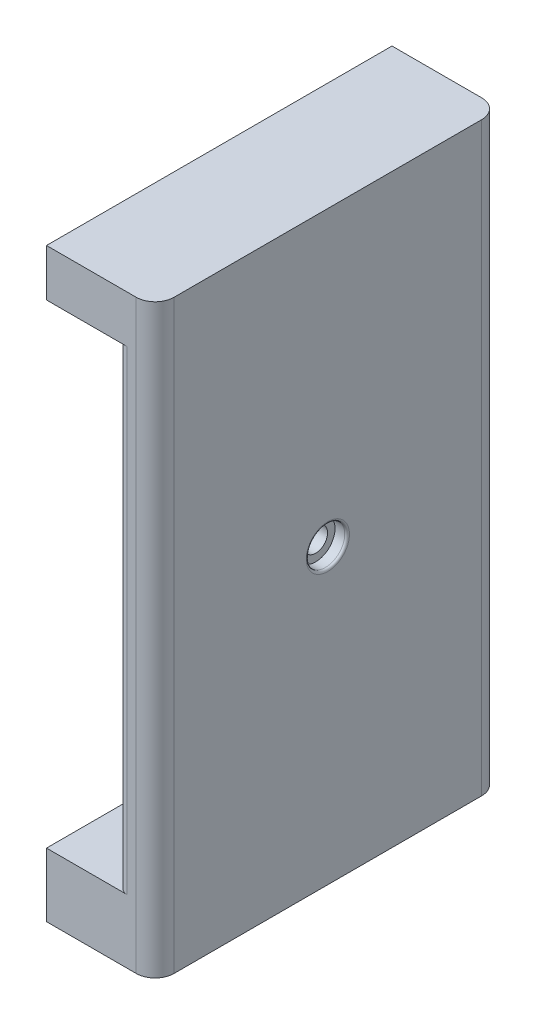
ISO-10303-21;
HEADER;
FILE_DESCRIPTION(('STEP AP214'),'2;1');
FILE_NAME('part.step','',(''),(''),'','','');
FILE_SCHEMA(('AUTOMOTIVE_DESIGN { 1 0 10303 214 1 1 1 1 }'));
ENDSEC;
DATA;
#1=APPLICATION_CONTEXT('core data for automotive mechanical design processes');
#2=APPLICATION_PROTOCOL_DEFINITION('international standard','automotive_design',2000,#1);
#3=PRODUCT_CONTEXT('',#1,'mechanical');
#4=PRODUCT('Part','Part','',(#3));
#5=PRODUCT_RELATED_PRODUCT_CATEGORY('part','',(#4));
#6=PRODUCT_DEFINITION_FORMATION('','',#4);
#7=PRODUCT_DEFINITION_CONTEXT('part definition',#1,'design');
#8=PRODUCT_DEFINITION('design','',#6,#7);
#9=PRODUCT_DEFINITION_SHAPE('','',#8);
#10=(LENGTH_UNIT() NAMED_UNIT(*) SI_UNIT(.MILLI.,.METRE.));
#11=(NAMED_UNIT(*) PLANE_ANGLE_UNIT() SI_UNIT($,.RADIAN.));
#12=(NAMED_UNIT(*) SI_UNIT($,.STERADIAN.) SOLID_ANGLE_UNIT());
#13=UNCERTAINTY_MEASURE_WITH_UNIT(LENGTH_MEASURE(1.E-05),#10,'distance_accuracy_value','');
#14=(GEOMETRIC_REPRESENTATION_CONTEXT(3) GLOBAL_UNCERTAINTY_ASSIGNED_CONTEXT((#13)) GLOBAL_UNIT_ASSIGNED_CONTEXT((#10,
#11,#12)) REPRESENTATION_CONTEXT('',''));
#15=CARTESIAN_POINT('',(0.,0.,0.));
#16=DIRECTION('',(0.,0.,1.));
#17=DIRECTION('',(1.,0.,0.));
#18=AXIS2_PLACEMENT_3D('',#15,#16,#17);
#19=CARTESIAN_POINT('',(20.255,0.,0.));
#20=DIRECTION('',(1.,0.,0.));
#21=DIRECTION('',(0.,1.,0.));
#22=AXIS2_PLACEMENT_3D('',#19,#20,#21);
#23=PLANE('',#22);
#24=CARTESIAN_POINT('',(20.255,0.,0.));
#25=DIRECTION('',(1.,0.,0.));
#26=DIRECTION('',(0.,1.,0.));
#27=AXIS2_PLACEMENT_3D('',#24,#25,#26);
#28=CIRCLE('',#27,20.25);
#29=CARTESIAN_POINT('',(20.255,20.25,0.));
#30=VERTEX_POINT('',#29);
#31=EDGE_CURVE('E254',#30,#30,#28,.T.);
#32=ORIENTED_EDGE('',*,*,#31,.T.);
#33=EDGE_LOOP('',(#32));
#34=FACE_BOUND('',#33,.T.);
#35=DIRECTION('',(0.,0.,1.));
#36=VECTOR('',#35,1.);
#37=CARTESIAN_POINT('',(20.255,52.,-36.576));
#38=LINE('',#37,#36);
#39=CARTESIAN_POINT('',(20.255,52.,-34.576));
#40=VERTEX_POINT('',#39);
#41=CARTESIAN_POINT('',(20.255,52.,34.576));
#42=VERTEX_POINT('',#41);
#43=EDGE_CURVE('E156',#40,#42,#38,.T.);
#44=ORIENTED_EDGE('',*,*,#43,.F.);
#45=DIRECTION('',(0.,1.,0.));
#46=VECTOR('',#45,1.);
#47=CARTESIAN_POINT('',(20.255,0.,-34.576));
#48=LINE('',#47,#46);
#49=CARTESIAN_POINT('',(20.255,-48.5,-34.576));
#50=VERTEX_POINT('',#49);
#51=EDGE_CURVE('E258',#40,#50,#48,.F.);
#52=ORIENTED_EDGE('',*,*,#51,.T.);
#53=DIRECTION('',(0.,0.,-1.));
#54=VECTOR('',#53,1.);
#55=CARTESIAN_POINT('',(20.255,-48.5,-36.576));
#56=LINE('',#55,#54);
#57=CARTESIAN_POINT('',(20.255,-48.5,34.576));
#58=VERTEX_POINT('',#57);
#59=EDGE_CURVE('E163',#58,#50,#56,.T.);
#60=ORIENTED_EDGE('',*,*,#59,.F.);
#61=DIRECTION('',(0.,1.,0.));
#62=VECTOR('',#61,1.);
#63=CARTESIAN_POINT('',(20.255,52.,34.576));
#64=LINE('',#63,#62);
#65=EDGE_CURVE('E250',#58,#42,#64,.T.);
#66=ORIENTED_EDGE('',*,*,#65,.T.);
#67=EDGE_LOOP('',(#44,#52,#60,#66));
#68=FACE_BOUND('',#67,.T.);
#69=ADVANCED_FACE('F47',(#34,#68),#23,.F.);
#70=CARTESIAN_POINT('',(8.25500000000001,0.,0.));
#71=DIRECTION('',(1.,0.,0.));
#72=DIRECTION('',(0.,1.,0.));
#73=AXIS2_PLACEMENT_3D('',#70,#71,#72);
#74=PLANE('',#73);
#75=CARTESIAN_POINT('',(8.25500000000001,0.,0.));
#76=DIRECTION('',(-1.,0.,0.));
#77=DIRECTION('',(0.,-1.,0.));
#78=AXIS2_PLACEMENT_3D('',#75,#76,#77);
#79=CIRCLE('',#78,13.15);
#80=CARTESIAN_POINT('',(8.25500000000001,-13.15,0.));
#81=VERTEX_POINT('',#80);
#82=EDGE_CURVE('E236',#81,#81,#79,.T.);
#83=ORIENTED_EDGE('',*,*,#82,.F.);
#84=EDGE_LOOP('',(#83));
#85=FACE_BOUND('',#84,.T.);
#86=CARTESIAN_POINT('',(8.25500000000001,0.,0.));
#87=DIRECTION('',(-1.,0.,0.));
#88=DIRECTION('',(0.,-1.,0.));
#89=AXIS2_PLACEMENT_3D('',#86,#87,#88);
#90=CIRCLE('',#89,18.25);
#91=CARTESIAN_POINT('',(8.25500000000002,-18.25,0.));
#92=VERTEX_POINT('',#91);
#93=EDGE_CURVE('E241',#92,#92,#90,.T.);
#94=ORIENTED_EDGE('',*,*,#93,.T.);
#95=EDGE_LOOP('',(#94));
#96=FACE_BOUND('',#95,.T.);
#97=ADVANCED_FACE('F387',(#85,#96),#74,.F.);
#98=CARTESIAN_POINT('',(8.255,0.,0.));
#99=DIRECTION('',(-1.,0.,0.));
#100=DIRECTION('',(0.,-1.,0.));
#101=AXIS2_PLACEMENT_3D('',#98,#99,#100);
#102=CYLINDRICAL_SURFACE('',#101,18.25);
#103=CARTESIAN_POINT('',(18.255,0.,0.));
#104=DIRECTION('',(1.,0.,0.));
#105=DIRECTION('',(0.,1.,0.));
#106=AXIS2_PLACEMENT_3D('',#103,#104,#105);
#107=CIRCLE('',#106,18.25);
#108=CARTESIAN_POINT('',(18.255,18.25,0.));
#109=VERTEX_POINT('',#108);
#110=EDGE_CURVE('E261',#109,#109,#107,.F.);
#111=ORIENTED_EDGE('',*,*,#110,.T.);
#112=EDGE_LOOP('',(#111));
#113=FACE_BOUND('',#112,.T.);
#114=ORIENTED_EDGE('',*,*,#93,.F.);
#115=EDGE_LOOP('',(#114));
#116=FACE_BOUND('',#115,.T.);
#117=ADVANCED_FACE('F394',(#113,#116),#102,.T.);
#118=CARTESIAN_POINT('',(20.255,0.,0.));
#119=DIRECTION('',(-1.,0.,0.));
#120=DIRECTION('',(0.,-1.,0.));
#121=AXIS2_PLACEMENT_3D('',#118,#119,#120);
#122=CYLINDRICAL_SURFACE('',#121,13.15);
#123=CARTESIAN_POINT('',(20.255,0.,0.));
#124=DIRECTION('',(-1.,0.,0.));
#125=DIRECTION('',(0.,-1.,0.));
#126=AXIS2_PLACEMENT_3D('',#123,#124,#125);
#127=CIRCLE('',#126,13.15);
#128=CARTESIAN_POINT('',(20.255,-13.15,0.));
#129=VERTEX_POINT('',#128);
#130=EDGE_CURVE('E237',#129,#129,#127,.T.);
#131=ORIENTED_EDGE('',*,*,#130,.F.);
#132=EDGE_LOOP('',(#131));
#133=FACE_BOUND('',#132,.T.);
#134=ORIENTED_EDGE('',*,*,#82,.T.);
#135=EDGE_LOOP('',(#134));
#136=FACE_BOUND('',#135,.T.);
#137=ADVANCED_FACE('F400',(#133,#136),#122,.F.);
#138=CARTESIAN_POINT('',(20.255,0.,0.));
#139=DIRECTION('',(1.,0.,0.));
#140=DIRECTION('',(0.,1.,0.));
#141=AXIS2_PLACEMENT_3D('',#138,#139,#140);
#142=CIRCLE('',#141,2.5);
#143=CARTESIAN_POINT('',(20.255,2.50000000000001,0.));
#144=VERTEX_POINT('',#143);
#145=EDGE_CURVE('E228',#144,#144,#142,.F.);
#146=ORIENTED_EDGE('',*,*,#145,.F.);
#147=EDGE_LOOP('',(#146));
#148=FACE_BOUND('',#147,.T.);
#149=ORIENTED_EDGE('',*,*,#130,.T.);
#150=EDGE_LOOP('',(#149));
#151=FACE_BOUND('',#150,.T.);
#152=ADVANCED_FACE('F390',(#148,#151),#23,.F.);
#153=CARTESIAN_POINT('',(28.255,0.,36.576));
#154=DIRECTION('',(0.,0.,1.));
#155=DIRECTION('',(1.,0.,0.));
#156=AXIS2_PLACEMENT_3D('',#153,#154,#155);
#157=PLANE('',#156);
#158=DIRECTION('',(1.,0.,0.));
#159=VECTOR('',#158,1.);
#160=CARTESIAN_POINT('',(5.25499999999997,52.,36.576));
#161=LINE('',#160,#159);
#162=CARTESIAN_POINT('',(5.25499999999997,52.,36.576));
#163=VERTEX_POINT('',#162);
#164=CARTESIAN_POINT('',(22.255,52.,36.576));
#165=VERTEX_POINT('',#164);
#166=EDGE_CURVE('E63',#163,#165,#161,.T.);
#167=ORIENTED_EDGE('',*,*,#166,.T.);
#168=DIRECTION('',(0.,1.,0.));
#169=VECTOR('',#168,1.);
#170=CARTESIAN_POINT('',(22.255,-48.5,36.576));
#171=LINE('',#170,#169);
#172=CARTESIAN_POINT('',(22.255,-48.5,36.576));
#173=VERTEX_POINT('',#172);
#174=EDGE_CURVE('E265',#165,#173,#171,.F.);
#175=ORIENTED_EDGE('',*,*,#174,.T.);
#176=DIRECTION('',(1.,0.,0.));
#177=VECTOR('',#176,1.);
#178=CARTESIAN_POINT('',(5.25500000000004,-48.5,36.576));
#179=LINE('',#178,#177);
#180=CARTESIAN_POINT('',(5.25500000000004,-48.5,36.576));
#181=VERTEX_POINT('',#180);
#182=EDGE_CURVE('E70',#181,#173,#179,.T.);
#183=ORIENTED_EDGE('',*,*,#182,.F.);
#184=DIRECTION('',(0.,1.,0.));
#185=VECTOR('',#184,1.);
#186=CARTESIAN_POINT('',(5.25500000000004,-48.5,36.576));
#187=LINE('',#186,#185);
#188=CARTESIAN_POINT('',(5.25500000000005,-62.,36.576));
#189=VERTEX_POINT('',#188);
#190=EDGE_CURVE('E181',#189,#181,#187,.T.);
#191=ORIENTED_EDGE('',*,*,#190,.F.);
#192=DIRECTION('',(-1.,0.,0.));
#193=VECTOR('',#192,1.);
#194=CARTESIAN_POINT('',(28.255,-62.,36.576));
#195=LINE('',#194,#193);
#196=CARTESIAN_POINT('',(24.255,-62.,36.576));
#197=VERTEX_POINT('',#196);
#198=EDGE_CURVE('E191',#197,#189,#195,.T.);
#199=ORIENTED_EDGE('',*,*,#198,.F.);
#200=DIRECTION('',(0.,1.,0.));
#201=VECTOR('',#200,1.);
#202=CARTESIAN_POINT('',(24.255,0.,36.576));
#203=LINE('',#202,#201);
#204=CARTESIAN_POINT('',(24.255,62.,36.576));
#205=VERTEX_POINT('',#204);
#206=EDGE_CURVE('E196',#197,#205,#203,.T.);
#207=ORIENTED_EDGE('',*,*,#206,.T.);
#208=DIRECTION('',(-1.,0.,0.));
#209=VECTOR('',#208,1.);
#210=CARTESIAN_POINT('',(28.255,62.,36.576));
#211=LINE('',#210,#209);
#212=CARTESIAN_POINT('',(5.25499999999996,62.,36.576));
#213=VERTEX_POINT('',#212);
#214=EDGE_CURVE('E310',#205,#213,#211,.T.);
#215=ORIENTED_EDGE('',*,*,#214,.T.);
#216=DIRECTION('',(0.,1.,0.));
#217=VECTOR('',#216,1.);
#218=CARTESIAN_POINT('',(5.25499999999996,62.,36.576));
#219=LINE('',#218,#217);
#220=EDGE_CURVE('E145',#163,#213,#219,.T.);
#221=ORIENTED_EDGE('',*,*,#220,.F.);
#222=EDGE_LOOP('',(#167,#175,#183,#191,#199,#207,#215,#221));
#223=FACE_BOUND('',#222,.T.);
#224=ADVANCED_FACE('F281',(#223),#157,.T.);
#225=CARTESIAN_POINT('',(28.255,-62.,0.));
#226=DIRECTION('',(0.,-1.,0.));
#227=DIRECTION('',(1.,0.,0.));
#228=AXIS2_PLACEMENT_3D('',#225,#226,#227);
#229=PLANE('',#228);
#230=CARTESIAN_POINT('',(18.42,-62.,12.75));
#231=DIRECTION('',(0.,-1.,0.));
#232=DIRECTION('',(1.,0.,0.));
#233=AXIS2_PLACEMENT_3D('',#230,#231,#232);
#234=CIRCLE('',#233,3.71375);
#235=CARTESIAN_POINT('',(22.13375,-62.,12.75));
#236=VERTEX_POINT('',#235);
#237=EDGE_CURVE('E345',#236,#236,#234,.T.);
#238=ORIENTED_EDGE('',*,*,#237,.F.);
#239=EDGE_LOOP('',(#238));
#240=FACE_BOUND('',#239,.T.);
#241=CARTESIAN_POINT('',(18.42,-62.,-12.75));
#242=DIRECTION('',(0.,-1.,0.));
#243=DIRECTION('',(1.,0.,0.));
#244=AXIS2_PLACEMENT_3D('',#241,#242,#243);
#245=CIRCLE('',#244,3.71375);
#246=CARTESIAN_POINT('',(22.13375,-62.,-12.75));
#247=VERTEX_POINT('',#246);
#248=EDGE_CURVE('E353',#247,#247,#245,.T.);
#249=ORIENTED_EDGE('',*,*,#248,.F.);
#250=EDGE_LOOP('',(#249));
#251=FACE_BOUND('',#250,.T.);
#252=DIRECTION('',(0.,0.,1.));
#253=VECTOR('',#252,1.);
#254=CARTESIAN_POINT('',(28.255,-62.,0.));
#255=LINE('',#254,#253);
#256=CARTESIAN_POINT('',(28.255,-62.,-32.576));
#257=VERTEX_POINT('',#256);
#258=CARTESIAN_POINT('',(28.255,-62.,32.5760000000001));
#259=VERTEX_POINT('',#258);
#260=EDGE_CURVE('E303',#257,#259,#255,.T.);
#261=ORIENTED_EDGE('',*,*,#260,.T.);
#262=CARTESIAN_POINT('',(24.255,-62.,32.5760000000001));
#263=DIRECTION('',(0.,-1.,0.));
#264=DIRECTION('',(1.,0.,0.));
#265=AXIS2_PLACEMENT_3D('',#262,#263,#264);
#266=CIRCLE('',#265,4.);
#267=EDGE_CURVE('E216',#259,#197,#266,.T.);
#268=ORIENTED_EDGE('',*,*,#267,.T.);
#269=ORIENTED_EDGE('',*,*,#198,.T.);
#270=DIRECTION('',(0.,0.,1.));
#271=VECTOR('',#270,1.);
#272=CARTESIAN_POINT('',(5.25500000000005,-62.,-36.576));
#273=LINE('',#272,#271);
#274=CARTESIAN_POINT('',(5.25500000000005,-62.,-36.576));
#275=VERTEX_POINT('',#274);
#276=EDGE_CURVE('E176',#275,#189,#273,.T.);
#277=ORIENTED_EDGE('',*,*,#276,.F.);
#278=DIRECTION('',(-1.,0.,0.));
#279=VECTOR('',#278,1.);
#280=CARTESIAN_POINT('',(28.255,-62.,-36.576));
#281=LINE('',#280,#279);
#282=CARTESIAN_POINT('',(24.255,-62.,-36.576));
#283=VERTEX_POINT('',#282);
#284=EDGE_CURVE('E186',#283,#275,#281,.T.);
#285=ORIENTED_EDGE('',*,*,#284,.F.);
#286=CARTESIAN_POINT('',(24.255,-62.,-32.576));
#287=DIRECTION('',(0.,-1.,0.));
#288=DIRECTION('',(1.,0.,0.));
#289=AXIS2_PLACEMENT_3D('',#286,#287,#288);
#290=CIRCLE('',#289,4.);
#291=EDGE_CURVE('E213',#283,#257,#290,.T.);
#292=ORIENTED_EDGE('',*,*,#291,.T.);
#293=EDGE_LOOP('',(#261,#268,#269,#277,#285,#292));
#294=FACE_BOUND('',#293,.T.);
#295=ADVANCED_FACE('F325',(#240,#251,#294),#229,.T.);
#296=CARTESIAN_POINT('',(28.255,0.,-36.576));
#297=DIRECTION('',(0.,0.,1.));
#298=DIRECTION('',(1.,0.,0.));
#299=AXIS2_PLACEMENT_3D('',#296,#297,#298);
#300=PLANE('',#299);
#301=DIRECTION('',(0.,1.,0.));
#302=VECTOR('',#301,1.);
#303=CARTESIAN_POINT('',(22.255,0.,-36.576));
#304=LINE('',#303,#302);
#305=CARTESIAN_POINT('',(22.255,-48.5,-36.576));
#306=VERTEX_POINT('',#305);
#307=CARTESIAN_POINT('',(22.255,52.,-36.576));
#308=VERTEX_POINT('',#307);
#309=EDGE_CURVE('E161',#306,#308,#304,.T.);
#310=ORIENTED_EDGE('',*,*,#309,.T.);
#311=DIRECTION('',(1.,0.,0.));
#312=VECTOR('',#311,1.);
#313=CARTESIAN_POINT('',(5.25499999999997,52.,-36.576));
#314=LINE('',#313,#312);
#315=CARTESIAN_POINT('',(5.25499999999997,52.,-36.576));
#316=VERTEX_POINT('',#315);
#317=EDGE_CURVE('E140',#316,#308,#314,.T.);
#318=ORIENTED_EDGE('',*,*,#317,.F.);
#319=DIRECTION('',(0.,-1.,0.));
#320=VECTOR('',#319,1.);
#321=CARTESIAN_POINT('',(5.25499999999996,62.,-36.576));
#322=LINE('',#321,#320);
#323=CARTESIAN_POINT('',(5.25499999999996,62.,-36.576));
#324=VERTEX_POINT('',#323);
#325=EDGE_CURVE('E146',#324,#316,#322,.T.);
#326=ORIENTED_EDGE('',*,*,#325,.F.);
#327=DIRECTION('',(-1.,0.,0.));
#328=VECTOR('',#327,1.);
#329=CARTESIAN_POINT('',(28.255,62.,-36.576));
#330=LINE('',#329,#328);
#331=CARTESIAN_POINT('',(24.255,62.,-36.576));
#332=VERTEX_POINT('',#331);
#333=EDGE_CURVE('E192',#332,#324,#330,.T.);
#334=ORIENTED_EDGE('',*,*,#333,.F.);
#335=DIRECTION('',(0.,1.,0.));
#336=VECTOR('',#335,1.);
#337=CARTESIAN_POINT('',(24.255,-62.,-36.576));
#338=LINE('',#337,#336);
#339=EDGE_CURVE('E219',#332,#283,#338,.F.);
#340=ORIENTED_EDGE('',*,*,#339,.T.);
#341=ORIENTED_EDGE('',*,*,#284,.T.);
#342=DIRECTION('',(0.,-1.,0.));
#343=VECTOR('',#342,1.);
#344=CARTESIAN_POINT('',(5.25500000000004,-48.5,-36.576));
#345=LINE('',#344,#343);
#346=CARTESIAN_POINT('',(5.25500000000004,-48.5,-36.576));
#347=VERTEX_POINT('',#346);
#348=EDGE_CURVE('E168',#347,#275,#345,.T.);
#349=ORIENTED_EDGE('',*,*,#348,.F.);
#350=DIRECTION('',(1.,0.,0.));
#351=VECTOR('',#350,1.);
#352=CARTESIAN_POINT('',(5.25500000000004,-48.5,-36.576));
#353=LINE('',#352,#351);
#354=EDGE_CURVE('E285',#347,#306,#353,.T.);
#355=ORIENTED_EDGE('',*,*,#354,.T.);
#356=EDGE_LOOP('',(#310,#318,#326,#334,#340,#341,#349,#355));
#357=FACE_BOUND('',#356,.T.);
#358=ADVANCED_FACE('F159',(#357),#300,.F.);
#359=CARTESIAN_POINT('',(28.255,62.,0.));
#360=DIRECTION('',(0.,-1.,0.));
#361=DIRECTION('',(1.,0.,0.));
#362=AXIS2_PLACEMENT_3D('',#359,#360,#361);
#363=PLANE('',#362);
#364=ORIENTED_EDGE('',*,*,#214,.F.);
#365=CARTESIAN_POINT('',(24.255,62.,32.5760000000001));
#366=DIRECTION('',(0.,-1.,0.));
#367=DIRECTION('',(1.,0.,0.));
#368=AXIS2_PLACEMENT_3D('',#365,#366,#367);
#369=CIRCLE('',#368,4.);
#370=CARTESIAN_POINT('',(28.255,62.,32.5760000000001));
#371=VERTEX_POINT('',#370);
#372=EDGE_CURVE('E203',#205,#371,#369,.F.);
#373=ORIENTED_EDGE('',*,*,#372,.T.);
#374=DIRECTION('',(0.,0.,1.));
#375=VECTOR('',#374,1.);
#376=CARTESIAN_POINT('',(28.255,62.,0.));
#377=LINE('',#376,#375);
#378=CARTESIAN_POINT('',(28.255,62.,-32.576));
#379=VERTEX_POINT('',#378);
#380=EDGE_CURVE('E307',#379,#371,#377,.T.);
#381=ORIENTED_EDGE('',*,*,#380,.F.);
#382=CARTESIAN_POINT('',(24.255,62.,-32.576));
#383=DIRECTION('',(0.,-1.,0.));
#384=DIRECTION('',(1.,0.,0.));
#385=AXIS2_PLACEMENT_3D('',#382,#383,#384);
#386=CIRCLE('',#385,4.);
#387=EDGE_CURVE('E200',#379,#332,#386,.F.);
#388=ORIENTED_EDGE('',*,*,#387,.T.);
#389=ORIENTED_EDGE('',*,*,#333,.T.);
#390=DIRECTION('',(0.,0.,-1.));
#391=VECTOR('',#390,1.);
#392=CARTESIAN_POINT('',(5.25499999999996,62.,-36.576));
#393=LINE('',#392,#391);
#394=EDGE_CURVE('E152',#213,#324,#393,.T.);
#395=ORIENTED_EDGE('',*,*,#394,.F.);
#396=EDGE_LOOP('',(#364,#373,#381,#388,#389,#395));
#397=FACE_BOUND('',#396,.T.);
#398=ADVANCED_FACE('F315',(#397),#363,.F.);
#399=CARTESIAN_POINT('',(28.255,0.,0.));
#400=DIRECTION('',(1.,0.,0.));
#401=DIRECTION('',(0.,1.,0.));
#402=AXIS2_PLACEMENT_3D('',#399,#400,#401);
#403=PLANE('',#402);
#404=CARTESIAN_POINT('',(28.255,0.,0.));
#405=DIRECTION('',(1.,0.,0.));
#406=DIRECTION('',(0.,1.,0.));
#407=AXIS2_PLACEMENT_3D('',#404,#405,#406);
#408=CIRCLE('',#407,4.575);
#409=CARTESIAN_POINT('',(28.255,4.57500000000002,0.));
#410=VERTEX_POINT('',#409);
#411=EDGE_CURVE('E232',#410,#410,#408,.F.);
#412=ORIENTED_EDGE('',*,*,#411,.T.);
#413=EDGE_LOOP('',(#412));
#414=FACE_BOUND('',#413,.T.);
#415=ORIENTED_EDGE('',*,*,#380,.T.);
#416=DIRECTION('',(0.,1.,0.));
#417=VECTOR('',#416,1.);
#418=CARTESIAN_POINT('',(28.255,0.,32.5760000000001));
#419=LINE('',#418,#417);
#420=EDGE_CURVE('E210',#371,#259,#419,.F.);
#421=ORIENTED_EDGE('',*,*,#420,.T.);
#422=ORIENTED_EDGE('',*,*,#260,.F.);
#423=DIRECTION('',(0.,1.,0.));
#424=VECTOR('',#423,1.);
#425=CARTESIAN_POINT('',(28.255,62.,-32.576));
#426=LINE('',#425,#424);
#427=EDGE_CURVE('E206',#257,#379,#426,.T.);
#428=ORIENTED_EDGE('',*,*,#427,.T.);
#429=EDGE_LOOP('',(#415,#421,#422,#428));
#430=FACE_BOUND('',#429,.T.);
#431=ADVANCED_FACE('F329',(#414,#430),#403,.T.);
#432=CARTESIAN_POINT('',(24.255,0.,32.5760000000001));
#433=DIRECTION('',(0.,1.,0.));
#434=DIRECTION('',(-1.,0.,0.));
#435=AXIS2_PLACEMENT_3D('',#432,#433,#434);
#436=CYLINDRICAL_SURFACE('',#435,4.);
#437=ORIENTED_EDGE('',*,*,#267,.F.);
#438=ORIENTED_EDGE('',*,*,#420,.F.);
#439=ORIENTED_EDGE('',*,*,#372,.F.);
#440=ORIENTED_EDGE('',*,*,#206,.F.);
#441=EDGE_LOOP('',(#437,#438,#439,#440));
#442=FACE_BOUND('',#441,.T.);
#443=ADVANCED_FACE('F332',(#442),#436,.T.);
#444=CARTESIAN_POINT('',(24.255,0.,-32.576));
#445=DIRECTION('',(0.,-1.,0.));
#446=DIRECTION('',(1.,0.,0.));
#447=AXIS2_PLACEMENT_3D('',#444,#445,#446);
#448=CYLINDRICAL_SURFACE('',#447,4.);
#449=ORIENTED_EDGE('',*,*,#291,.F.);
#450=ORIENTED_EDGE('',*,*,#339,.F.);
#451=ORIENTED_EDGE('',*,*,#387,.F.);
#452=ORIENTED_EDGE('',*,*,#427,.F.);
#453=EDGE_LOOP('',(#449,#450,#451,#452));
#454=FACE_BOUND('',#453,.T.);
#455=ADVANCED_FACE('F321',(#454),#448,.T.);
#456=CARTESIAN_POINT('',(25.695,0.,0.));
#457=DIRECTION('',(1.,0.,0.));
#458=DIRECTION('',(0.,1.,0.));
#459=AXIS2_PLACEMENT_3D('',#456,#457,#458);
#460=CYLINDRICAL_SURFACE('',#459,4.075);
#461=CARTESIAN_POINT('',(27.755,0.,0.));
#462=DIRECTION('',(1.,0.,0.));
#463=DIRECTION('',(0.,1.,0.));
#464=AXIS2_PLACEMENT_3D('',#461,#462,#463);
#465=CIRCLE('',#464,4.075);
#466=CARTESIAN_POINT('',(27.755,4.07500000000002,0.));
#467=VERTEX_POINT('',#466);
#468=EDGE_CURVE('E222',#467,#467,#465,.T.);
#469=ORIENTED_EDGE('',*,*,#468,.T.);
#470=EDGE_LOOP('',(#469));
#471=FACE_BOUND('',#470,.T.);
#472=CARTESIAN_POINT('',(25.695,0.,0.));
#473=DIRECTION('',(1.,0.,0.));
#474=DIRECTION('',(0.,1.,0.));
#475=AXIS2_PLACEMENT_3D('',#472,#473,#474);
#476=CIRCLE('',#475,4.075);
#477=CARTESIAN_POINT('',(25.695,4.07500000000002,0.));
#478=VERTEX_POINT('',#477);
#479=EDGE_CURVE('E227',#478,#478,#476,.T.);
#480=ORIENTED_EDGE('',*,*,#479,.F.);
#481=EDGE_LOOP('',(#480));
#482=FACE_BOUND('',#481,.T.);
#483=ADVANCED_FACE('F514',(#471,#482),#460,.F.);
#484=CARTESIAN_POINT('',(25.695,0.,0.));
#485=DIRECTION('',(1.,0.,0.));
#486=DIRECTION('',(0.,1.,0.));
#487=AXIS2_PLACEMENT_3D('',#484,#485,#486);
#488=PLANE('',#487);
#489=CARTESIAN_POINT('',(25.695,0.,0.));
#490=DIRECTION('',(1.,0.,0.));
#491=DIRECTION('',(0.,1.,0.));
#492=AXIS2_PLACEMENT_3D('',#489,#490,#491);
#493=CIRCLE('',#492,2.5);
#494=CARTESIAN_POINT('',(25.695,2.50000000000002,0.));
#495=VERTEX_POINT('',#494);
#496=EDGE_CURVE('E223',#495,#495,#493,.T.);
#497=ORIENTED_EDGE('',*,*,#496,.F.);
#498=EDGE_LOOP('',(#497));
#499=FACE_BOUND('',#498,.T.);
#500=ORIENTED_EDGE('',*,*,#479,.T.);
#501=EDGE_LOOP('',(#500));
#502=FACE_BOUND('',#501,.T.);
#503=ADVANCED_FACE('F520',(#499,#502),#488,.T.);
#504=CARTESIAN_POINT('',(13.1839321881345,0.,0.));
#505=DIRECTION('',(1.,0.,0.));
#506=DIRECTION('',(0.,1.,0.));
#507=AXIS2_PLACEMENT_3D('',#504,#505,#506);
#508=CYLINDRICAL_SURFACE('',#507,2.5);
#509=ORIENTED_EDGE('',*,*,#496,.T.);
#510=EDGE_LOOP('',(#509));
#511=FACE_BOUND('',#510,.T.);
#512=ORIENTED_EDGE('',*,*,#145,.T.);
#513=EDGE_LOOP('',(#512));
#514=FACE_BOUND('',#513,.T.);
#515=ADVANCED_FACE('F527',(#511,#514),#508,.F.);
#516=CARTESIAN_POINT('',(27.755,0.,0.));
#517=DIRECTION('',(1.,0.,0.));
#518=DIRECTION('',(0.,1.,0.));
#519=AXIS2_PLACEMENT_3D('',#516,#517,#518);
#520=TOROIDAL_SURFACE('',#519,4.575,0.5);
#521=ORIENTED_EDGE('',*,*,#411,.F.);
#522=EDGE_LOOP('',(#521));
#523=FACE_BOUND('',#522,.T.);
#524=ORIENTED_EDGE('',*,*,#468,.F.);
#525=EDGE_LOOP('',(#524));
#526=FACE_BOUND('',#525,.T.);
#527=ADVANCED_FACE('F534',(#523,#526),#520,.T.);
#528=CARTESIAN_POINT('',(5.25500000000004,-48.5,-36.576));
#529=DIRECTION('',(0.,-1.,0.));
#530=DIRECTION('',(1.,0.,0.));
#531=AXIS2_PLACEMENT_3D('',#528,#529,#530);
#532=PLANE('',#531);
#533=ORIENTED_EDGE('',*,*,#182,.T.);
#534=CARTESIAN_POINT('',(22.255,-48.5,34.576));
#535=DIRECTION('',(0.,-1.,0.));
#536=DIRECTION('',(1.,0.,0.));
#537=AXIS2_PLACEMENT_3D('',#534,#535,#536);
#538=CIRCLE('',#537,2.);
#539=EDGE_CURVE('E12',#173,#58,#538,.T.);
#540=ORIENTED_EDGE('',*,*,#539,.T.);
#541=ORIENTED_EDGE('',*,*,#59,.T.);
#542=CARTESIAN_POINT('',(22.255,-48.5,-34.576));
#543=DIRECTION('',(0.,-1.,0.));
#544=DIRECTION('',(1.,0.,0.));
#545=AXIS2_PLACEMENT_3D('',#542,#543,#544);
#546=CIRCLE('',#545,2.);
#547=EDGE_CURVE('E271',#50,#306,#546,.T.);
#548=ORIENTED_EDGE('',*,*,#547,.T.);
#549=ORIENTED_EDGE('',*,*,#354,.F.);
#550=DIRECTION('',(0.,0.,-1.));
#551=VECTOR('',#550,1.);
#552=CARTESIAN_POINT('',(5.25500000000004,-48.5,-36.576));
#553=LINE('',#552,#551);
#554=EDGE_CURVE('E288',#181,#347,#553,.T.);
#555=ORIENTED_EDGE('',*,*,#554,.F.);
#556=EDGE_LOOP('',(#533,#540,#541,#548,#549,#555));
#557=FACE_BOUND('',#556,.T.);
#558=ADVANCED_FACE('F289',(#557),#532,.F.);
#559=CARTESIAN_POINT('',(5.25500000000002,0.,0.));
#560=DIRECTION('',(-1.,0.,0.));
#561=DIRECTION('',(0.,-1.,0.));
#562=AXIS2_PLACEMENT_3D('',#559,#560,#561);
#563=PLANE('',#562);
#564=ORIENTED_EDGE('',*,*,#348,.T.);
#565=ORIENTED_EDGE('',*,*,#276,.T.);
#566=ORIENTED_EDGE('',*,*,#190,.T.);
#567=ORIENTED_EDGE('',*,*,#554,.T.);
#568=EDGE_LOOP('',(#564,#565,#566,#567));
#569=FACE_BOUND('',#568,.T.);
#570=ADVANCED_FACE('F334',(#569),#563,.T.);
#571=CARTESIAN_POINT('',(5.25499999999997,52.,-36.576));
#572=DIRECTION('',(0.,1.,0.));
#573=DIRECTION('',(-1.,0.,0.));
#574=AXIS2_PLACEMENT_3D('',#571,#572,#573);
#575=PLANE('',#574);
#576=ORIENTED_EDGE('',*,*,#317,.T.);
#577=CARTESIAN_POINT('',(22.255,52.,-34.576));
#578=DIRECTION('',(0.,1.,0.));
#579=DIRECTION('',(-1.,0.,0.));
#580=AXIS2_PLACEMENT_3D('',#577,#578,#579);
#581=CIRCLE('',#580,2.);
#582=EDGE_CURVE('E268',#308,#40,#581,.T.);
#583=ORIENTED_EDGE('',*,*,#582,.T.);
#584=ORIENTED_EDGE('',*,*,#43,.T.);
#585=CARTESIAN_POINT('',(22.255,52.,34.576));
#586=DIRECTION('',(0.,1.,0.));
#587=DIRECTION('',(-1.,0.,0.));
#588=AXIS2_PLACEMENT_3D('',#585,#586,#587);
#589=CIRCLE('',#588,2.);
#590=EDGE_CURVE('E56',#42,#165,#589,.T.);
#591=ORIENTED_EDGE('',*,*,#590,.T.);
#592=ORIENTED_EDGE('',*,*,#166,.F.);
#593=DIRECTION('',(0.,0.,1.));
#594=VECTOR('',#593,1.);
#595=CARTESIAN_POINT('',(5.25499999999997,52.,-36.576));
#596=LINE('',#595,#594);
#597=EDGE_CURVE('E136',#316,#163,#596,.T.);
#598=ORIENTED_EDGE('',*,*,#597,.F.);
#599=EDGE_LOOP('',(#576,#583,#584,#591,#592,#598));
#600=FACE_BOUND('',#599,.T.);
#601=ADVANCED_FACE('F138',(#600),#575,.F.);
#602=CARTESIAN_POINT('',(5.25500000000001,0.,0.));
#603=DIRECTION('',(-1.,0.,0.));
#604=DIRECTION('',(0.,-1.,0.));
#605=AXIS2_PLACEMENT_3D('',#602,#603,#604);
#606=PLANE('',#605);
#607=ORIENTED_EDGE('',*,*,#325,.T.);
#608=ORIENTED_EDGE('',*,*,#597,.T.);
#609=ORIENTED_EDGE('',*,*,#220,.T.);
#610=ORIENTED_EDGE('',*,*,#394,.T.);
#611=EDGE_LOOP('',(#607,#608,#609,#610));
#612=FACE_BOUND('',#611,.T.);
#613=ADVANCED_FACE('F150',(#612),#606,.T.);
#614=CARTESIAN_POINT('',(22.255,0.,-34.576));
#615=DIRECTION('',(0.,1.,0.));
#616=DIRECTION('',(-1.,0.,0.));
#617=AXIS2_PLACEMENT_3D('',#614,#615,#616);
#618=CYLINDRICAL_SURFACE('',#617,2.);
#619=ORIENTED_EDGE('',*,*,#547,.F.);
#620=ORIENTED_EDGE('',*,*,#51,.F.);
#621=ORIENTED_EDGE('',*,*,#582,.F.);
#622=ORIENTED_EDGE('',*,*,#309,.F.);
#623=EDGE_LOOP('',(#619,#620,#621,#622));
#624=FACE_BOUND('',#623,.T.);
#625=ADVANCED_FACE('F339',(#624),#618,.T.);
#626=CARTESIAN_POINT('',(18.255,0.,0.));
#627=DIRECTION('',(1.,0.,0.));
#628=DIRECTION('',(0.,1.,0.));
#629=AXIS2_PLACEMENT_3D('',#626,#627,#628);
#630=TOROIDAL_SURFACE('',#629,20.25,2.);
#631=ORIENTED_EDGE('',*,*,#31,.F.);
#632=EDGE_LOOP('',(#631));
#633=FACE_BOUND('',#632,.T.);
#634=ORIENTED_EDGE('',*,*,#110,.F.);
#635=EDGE_LOOP('',(#634));
#636=FACE_BOUND('',#635,.T.);
#637=ADVANCED_FACE('F383',(#633,#636),#630,.F.);
#638=CARTESIAN_POINT('',(22.255,0.,34.576));
#639=DIRECTION('',(0.,-1.,0.));
#640=DIRECTION('',(1.,0.,0.));
#641=AXIS2_PLACEMENT_3D('',#638,#639,#640);
#642=CYLINDRICAL_SURFACE('',#641,2.);
#643=ORIENTED_EDGE('',*,*,#539,.F.);
#644=ORIENTED_EDGE('',*,*,#174,.F.);
#645=ORIENTED_EDGE('',*,*,#590,.F.);
#646=ORIENTED_EDGE('',*,*,#65,.F.);
#647=EDGE_LOOP('',(#643,#644,#645,#646));
#648=FACE_BOUND('',#647,.T.);
#649=ADVANCED_FACE('F49',(#648),#642,.T.);
#650=CARTESIAN_POINT('',(18.42,-52.5,-12.75));
#651=DIRECTION('',(0.,-1.,0.));
#652=DIRECTION('',(1.,0.,0.));
#653=AXIS2_PLACEMENT_3D('',#650,#651,#652);
#654=CYLINDRICAL_SURFACE('',#653,3.71375);
#655=CARTESIAN_POINT('',(18.42,-52.5,-12.75));
#656=DIRECTION('',(0.,-1.,0.));
#657=DIRECTION('',(1.,0.,0.));
#658=AXIS2_PLACEMENT_3D('',#655,#656,#657);
#659=CIRCLE('',#658,3.71375);
#660=CARTESIAN_POINT('',(22.13375,-52.5,-12.75));
#661=VERTEX_POINT('',#660);
#662=EDGE_CURVE('E357',#661,#661,#659,.T.);
#663=ORIENTED_EDGE('',*,*,#662,.F.);
#664=EDGE_LOOP('',(#663));
#665=FACE_BOUND('',#664,.T.);
#666=ORIENTED_EDGE('',*,*,#248,.T.);
#667=EDGE_LOOP('',(#666));
#668=FACE_BOUND('',#667,.T.);
#669=ADVANCED_FACE('F372',(#665,#668),#654,.F.);
#670=CARTESIAN_POINT('',(18.42,-52.5,-12.75));
#671=DIRECTION('',(0.,-1.,0.));
#672=DIRECTION('',(1.,0.,0.));
#673=AXIS2_PLACEMENT_3D('',#670,#671,#672);
#674=PLANE('',#673);
#675=ORIENTED_EDGE('',*,*,#662,.T.);
#676=EDGE_LOOP('',(#675));
#677=FACE_BOUND('',#676,.T.);
#678=ADVANCED_FACE('F374',(#677),#674,.T.);
#679=CARTESIAN_POINT('',(18.42,-52.5,12.75));
#680=DIRECTION('',(0.,-1.,0.));
#681=DIRECTION('',(1.,0.,0.));
#682=AXIS2_PLACEMENT_3D('',#679,#680,#681);
#683=CYLINDRICAL_SURFACE('',#682,3.71375);
#684=CARTESIAN_POINT('',(18.42,-52.5,12.75));
#685=DIRECTION('',(0.,-1.,0.));
#686=DIRECTION('',(1.,0.,0.));
#687=AXIS2_PLACEMENT_3D('',#684,#685,#686);
#688=CIRCLE('',#687,3.71375);
#689=CARTESIAN_POINT('',(22.13375,-52.5,12.75));
#690=VERTEX_POINT('',#689);
#691=EDGE_CURVE('E342',#690,#690,#688,.T.);
#692=ORIENTED_EDGE('',*,*,#691,.F.);
#693=EDGE_LOOP('',(#692));
#694=FACE_BOUND('',#693,.T.);
#695=ORIENTED_EDGE('',*,*,#237,.T.);
#696=EDGE_LOOP('',(#695));
#697=FACE_BOUND('',#696,.T.);
#698=ADVANCED_FACE('F365',(#694,#697),#683,.F.);
#699=CARTESIAN_POINT('',(18.42,-52.5,12.75));
#700=DIRECTION('',(0.,-1.,0.));
#701=DIRECTION('',(1.,0.,0.));
#702=AXIS2_PLACEMENT_3D('',#699,#700,#701);
#703=PLANE('',#702);
#704=ORIENTED_EDGE('',*,*,#691,.T.);
#705=EDGE_LOOP('',(#704));
#706=FACE_BOUND('',#705,.T.);
#707=ADVANCED_FACE('F468',(#706),#703,.T.);
#708=CLOSED_SHELL('',(#69,#97,#117,#137,#152,#224,#295,#358,#398,#431,#443,#455,#483,#503,#515,
#527,#558,#570,#601,#613,#625,#637,#649,#669,#678,#698,#707));
#709=MANIFOLD_SOLID_BREP('B2',#708);
#710=ADVANCED_BREP_SHAPE_REPRESENTATION('',(#18,#709),#14);
#711=SHAPE_DEFINITION_REPRESENTATION(#9,#710);
ENDSEC;
END-ISO-10303-21;
